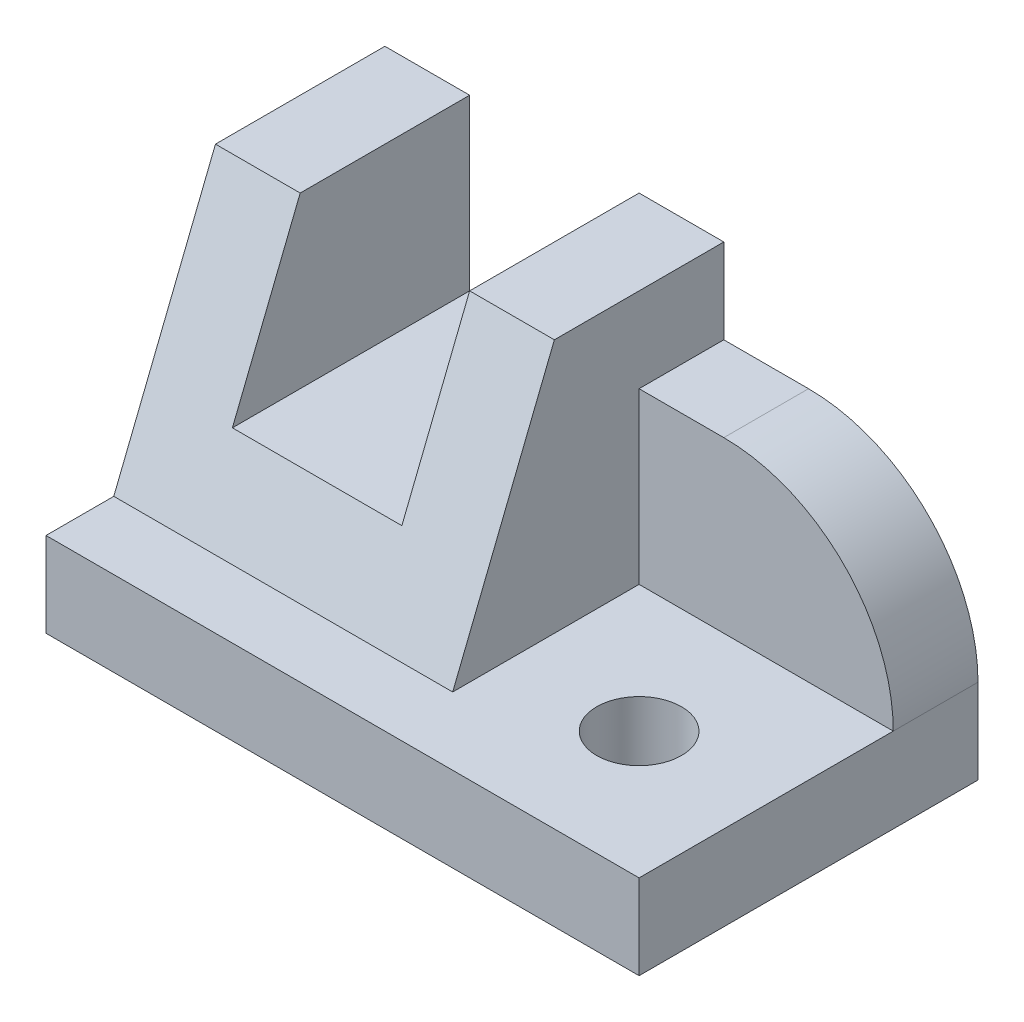
ISO-10303-21;
HEADER;
FILE_DESCRIPTION(('STEP AP214'),'2;1');
FILE_NAME('part.step','',(''),(''),'','','');
FILE_SCHEMA(('AUTOMOTIVE_DESIGN { 1 0 10303 214 1 1 1 1 }'));
ENDSEC;
DATA;
#1=APPLICATION_CONTEXT('core data for automotive mechanical design processes');
#2=APPLICATION_PROTOCOL_DEFINITION('international standard','automotive_design',2000,#1);
#3=PRODUCT_CONTEXT('',#1,'mechanical');
#4=PRODUCT('Part','Part','',(#3));
#5=PRODUCT_RELATED_PRODUCT_CATEGORY('part','',(#4));
#6=PRODUCT_DEFINITION_FORMATION('','',#4);
#7=PRODUCT_DEFINITION_CONTEXT('part definition',#1,'design');
#8=PRODUCT_DEFINITION('design','',#6,#7);
#9=PRODUCT_DEFINITION_SHAPE('','',#8);
#10=(LENGTH_UNIT() NAMED_UNIT(*) SI_UNIT(.MILLI.,.METRE.));
#11=(NAMED_UNIT(*) PLANE_ANGLE_UNIT() SI_UNIT($,.RADIAN.));
#12=(NAMED_UNIT(*) SI_UNIT($,.STERADIAN.) SOLID_ANGLE_UNIT());
#13=UNCERTAINTY_MEASURE_WITH_UNIT(LENGTH_MEASURE(1.E-05),#10,'distance_accuracy_value','');
#14=(GEOMETRIC_REPRESENTATION_CONTEXT(3) GLOBAL_UNCERTAINTY_ASSIGNED_CONTEXT((#13)) GLOBAL_UNIT_ASSIGNED_CONTEXT((#10,
#11,#12)) REPRESENTATION_CONTEXT('',''));
#15=CARTESIAN_POINT('',(0.,0.,0.));
#16=DIRECTION('',(0.,0.,1.));
#17=DIRECTION('',(1.,0.,0.));
#18=AXIS2_PLACEMENT_3D('',#15,#16,#17);
#19=CARTESIAN_POINT('',(40.,40.,-40.));
#20=DIRECTION('',(0.,-1.,0.));
#21=DIRECTION('',(0.,0.,-1.));
#22=AXIS2_PLACEMENT_3D('',#19,#20,#21);
#23=PLANE('',#22);
#24=DIRECTION('',(-1.,0.,0.));
#25=VECTOR('',#24,1.);
#26=CARTESIAN_POINT('',(40.,40.,-20.));
#27=LINE('',#26,#25);
#28=CARTESIAN_POINT('',(9.99999999999998,40.,-20.));
#29=VERTEX_POINT('',#28);
#30=CARTESIAN_POINT('',(0.,40.,-20.));
#31=VERTEX_POINT('',#30);
#32=EDGE_CURVE('E235',#29,#31,#27,.T.);
#33=ORIENTED_EDGE('',*,*,#32,.F.);
#34=DIRECTION('',(0.,0.,-1.));
#35=VECTOR('',#34,1.);
#36=CARTESIAN_POINT('',(9.99999999999998,40.,0.));
#37=LINE('',#36,#35);
#38=CARTESIAN_POINT('',(9.99999999999999,40.,-40.));
#39=VERTEX_POINT('',#38);
#40=EDGE_CURVE('E160',#29,#39,#37,.T.);
#41=ORIENTED_EDGE('',*,*,#40,.T.);
#42=DIRECTION('',(1.,0.,0.));
#43=VECTOR('',#42,1.);
#44=CARTESIAN_POINT('',(40.,40.,-40.));
#45=LINE('',#44,#43);
#46=CARTESIAN_POINT('',(0.,40.,-40.));
#47=VERTEX_POINT('',#46);
#48=EDGE_CURVE('E219',#47,#39,#45,.T.);
#49=ORIENTED_EDGE('',*,*,#48,.F.);
#50=DIRECTION('',(0.,0.,1.));
#51=VECTOR('',#50,1.);
#52=CARTESIAN_POINT('',(0.,40.,-40.));
#53=LINE('',#52,#51);
#54=EDGE_CURVE('E221',#47,#31,#53,.T.);
#55=ORIENTED_EDGE('',*,*,#54,.T.);
#56=EDGE_LOOP('',(#33,#41,#49,#55));
#57=FACE_BOUND('',#56,.T.);
#58=ADVANCED_FACE('F35',(#57),#23,.F.);
#59=CARTESIAN_POINT('',(40.,10.,-8.00000000000001));
#60=DIRECTION('',(0.,0.371390676354104,0.928476690885259));
#61=DIRECTION('',(0.,-0.928476690885259,0.371390676354104));
#62=AXIS2_PLACEMENT_3D('',#59,#60,#61);
#63=PLANE('',#62);
#64=DIRECTION('',(0.,-0.928476690885259,0.371390676354104));
#65=VECTOR('',#64,1.);
#66=CARTESIAN_POINT('',(9.99999999999998,10.,-8.00000000000001));
#67=LINE('',#66,#65);
#68=CARTESIAN_POINT('',(9.99999999999998,20.,-12.));
#69=VERTEX_POINT('',#68);
#70=EDGE_CURVE('E168',#29,#69,#67,.T.);
#71=ORIENTED_EDGE('',*,*,#70,.F.);
#72=ORIENTED_EDGE('',*,*,#32,.T.);
#73=DIRECTION('',(0.,0.928476690885259,-0.371390676354104));
#74=VECTOR('',#73,1.);
#75=CARTESIAN_POINT('',(0.,10.,-8.00000000000001));
#76=LINE('',#75,#74);
#77=CARTESIAN_POINT('',(0.,10.,-8.00000000000001));
#78=VERTEX_POINT('',#77);
#79=EDGE_CURVE('E224',#78,#31,#76,.T.);
#80=ORIENTED_EDGE('',*,*,#79,.F.);
#81=DIRECTION('',(-1.,0.,0.));
#82=VECTOR('',#81,1.);
#83=CARTESIAN_POINT('',(40.,10.,-8.00000000000001));
#84=LINE('',#83,#82);
#85=CARTESIAN_POINT('',(40.,10.,-8.00000000000001));
#86=VERTEX_POINT('',#85);
#87=EDGE_CURVE('E228',#86,#78,#84,.T.);
#88=ORIENTED_EDGE('',*,*,#87,.F.);
#89=DIRECTION('',(0.,0.928476690885259,-0.371390676354104));
#90=VECTOR('',#89,1.);
#91=CARTESIAN_POINT('',(40.,10.,-8.00000000000001));
#92=LINE('',#91,#90);
#93=CARTESIAN_POINT('',(40.,40.,-20.));
#94=VERTEX_POINT('',#93);
#95=EDGE_CURVE('E225',#86,#94,#92,.T.);
#96=ORIENTED_EDGE('',*,*,#95,.T.);
#97=CARTESIAN_POINT('',(30.,40.,-20.));
#98=VERTEX_POINT('',#97);
#99=EDGE_CURVE('E231',#94,#98,#27,.T.);
#100=ORIENTED_EDGE('',*,*,#99,.T.);
#101=DIRECTION('',(0.,0.928476690885259,-0.371390676354104));
#102=VECTOR('',#101,1.);
#103=CARTESIAN_POINT('',(30.,10.,-8.00000000000001));
#104=LINE('',#103,#102);
#105=CARTESIAN_POINT('',(30.,20.,-12.));
#106=VERTEX_POINT('',#105);
#107=EDGE_CURVE('E163',#106,#98,#104,.T.);
#108=ORIENTED_EDGE('',*,*,#107,.F.);
#109=DIRECTION('',(1.,0.,0.));
#110=VECTOR('',#109,1.);
#111=CARTESIAN_POINT('',(40.,20.,-12.));
#112=LINE('',#111,#110);
#113=EDGE_CURVE('E140',#69,#106,#112,.T.);
#114=ORIENTED_EDGE('',*,*,#113,.F.);
#115=EDGE_LOOP('',(#71,#72,#80,#88,#96,#100,#108,#114));
#116=FACE_BOUND('',#115,.T.);
#117=ADVANCED_FACE('F267',(#116),#63,.T.);
#118=CARTESIAN_POINT('',(0.,0.,0.));
#119=DIRECTION('',(1.,0.,0.));
#120=DIRECTION('',(0.,0.,-1.));
#121=AXIS2_PLACEMENT_3D('',#118,#119,#120);
#122=PLANE('',#121);
#123=DIRECTION('',(0.,1.,0.));
#124=VECTOR('',#123,1.);
#125=CARTESIAN_POINT('',(0.,40.,-40.));
#126=LINE('',#125,#124);
#127=CARTESIAN_POINT('',(0.,0.,-40.));
#128=VERTEX_POINT('',#127);
#129=EDGE_CURVE('E216',#128,#47,#126,.T.);
#130=ORIENTED_EDGE('',*,*,#129,.F.);
#131=DIRECTION('',(0.,0.,-1.));
#132=VECTOR('',#131,1.);
#133=CARTESIAN_POINT('',(0.,0.,-40.));
#134=LINE('',#133,#132);
#135=CARTESIAN_POINT('',(0.,0.,0.));
#136=VERTEX_POINT('',#135);
#137=EDGE_CURVE('E174',#136,#128,#134,.T.);
#138=ORIENTED_EDGE('',*,*,#137,.F.);
#139=DIRECTION('',(0.,1.,0.));
#140=VECTOR('',#139,1.);
#141=CARTESIAN_POINT('',(0.,0.,0.));
#142=LINE('',#141,#140);
#143=CARTESIAN_POINT('',(0.,10.,0.));
#144=VERTEX_POINT('',#143);
#145=EDGE_CURVE('E192',#136,#144,#142,.T.);
#146=ORIENTED_EDGE('',*,*,#145,.T.);
#147=DIRECTION('',(0.,0.,-1.));
#148=VECTOR('',#147,1.);
#149=CARTESIAN_POINT('',(0.,10.,-40.));
#150=LINE('',#149,#148);
#151=EDGE_CURVE('E186',#144,#78,#150,.T.);
#152=ORIENTED_EDGE('',*,*,#151,.T.);
#153=ORIENTED_EDGE('',*,*,#79,.T.);
#154=ORIENTED_EDGE('',*,*,#54,.F.);
#155=EDGE_LOOP('',(#130,#138,#146,#152,#153,#154));
#156=FACE_BOUND('',#155,.T.);
#157=ADVANCED_FACE('F270',(#156),#122,.F.);
#158=CARTESIAN_POINT('',(30.,40.,-40.));
#159=VERTEX_POINT('',#158);
#160=CARTESIAN_POINT('',(40.,40.,-40.));
#161=VERTEX_POINT('',#160);
#162=EDGE_CURVE('E218',#159,#161,#45,.T.);
#163=ORIENTED_EDGE('',*,*,#162,.F.);
#164=DIRECTION('',(0.,0.,-1.));
#165=VECTOR('',#164,1.);
#166=CARTESIAN_POINT('',(30.,40.,0.));
#167=LINE('',#166,#165);
#168=EDGE_CURVE('E144',#98,#159,#167,.T.);
#169=ORIENTED_EDGE('',*,*,#168,.F.);
#170=ORIENTED_EDGE('',*,*,#99,.F.);
#171=DIRECTION('',(0.,0.,1.));
#172=VECTOR('',#171,1.);
#173=CARTESIAN_POINT('',(40.,40.,-40.));
#174=LINE('',#173,#172);
#175=EDGE_CURVE('E195',#161,#94,#174,.T.);
#176=ORIENTED_EDGE('',*,*,#175,.F.);
#177=EDGE_LOOP('',(#163,#169,#170,#176));
#178=FACE_BOUND('',#177,.T.);
#179=ADVANCED_FACE('F264',(#178),#23,.F.);
#180=CARTESIAN_POINT('',(0.,0.,-40.));
#181=DIRECTION('',(0.,0.,1.));
#182=DIRECTION('',(0.,-1.,0.));
#183=AXIS2_PLACEMENT_3D('',#180,#181,#182);
#184=PLANE('',#183);
#185=DIRECTION('',(1.,0.,0.));
#186=VECTOR('',#185,1.);
#187=CARTESIAN_POINT('',(40.,30.,-40.));
#188=LINE('',#187,#186);
#189=CARTESIAN_POINT('',(40.,30.,-40.));
#190=VERTEX_POINT('',#189);
#191=CARTESIAN_POINT('',(50.,30.,-40.));
#192=VERTEX_POINT('',#191);
#193=EDGE_CURVE('E209',#190,#192,#188,.T.);
#194=ORIENTED_EDGE('',*,*,#193,.T.);
#195=CARTESIAN_POINT('',(50.,9.99999999999999,-40.));
#196=DIRECTION('',(0.,0.,1.));
#197=DIRECTION('',(0.,-1.,0.));
#198=AXIS2_PLACEMENT_3D('',#195,#196,#197);
#199=CIRCLE('',#198,20.);
#200=CARTESIAN_POINT('',(70.,10.,-40.));
#201=VERTEX_POINT('',#200);
#202=EDGE_CURVE('E50',#192,#201,#199,.F.);
#203=ORIENTED_EDGE('',*,*,#202,.T.);
#204=DIRECTION('',(0.,1.,0.));
#205=VECTOR('',#204,1.);
#206=CARTESIAN_POINT('',(70.,40.,-40.));
#207=LINE('',#206,#205);
#208=CARTESIAN_POINT('',(70.,0.,-40.));
#209=VERTEX_POINT('',#208);
#210=EDGE_CURVE('E211',#209,#201,#207,.T.);
#211=ORIENTED_EDGE('',*,*,#210,.F.);
#212=DIRECTION('',(1.,0.,0.));
#213=VECTOR('',#212,1.);
#214=CARTESIAN_POINT('',(70.,0.,-40.));
#215=LINE('',#214,#213);
#216=EDGE_CURVE('E178',#128,#209,#215,.T.);
#217=ORIENTED_EDGE('',*,*,#216,.F.);
#218=ORIENTED_EDGE('',*,*,#129,.T.);
#219=ORIENTED_EDGE('',*,*,#48,.T.);
#220=DIRECTION('',(0.,1.,0.));
#221=VECTOR('',#220,1.);
#222=CARTESIAN_POINT('',(9.99999999999999,20.,-40.));
#223=LINE('',#222,#221);
#224=CARTESIAN_POINT('',(9.99999999999999,20.,-40.));
#225=VERTEX_POINT('',#224);
#226=EDGE_CURVE('E155',#225,#39,#223,.T.);
#227=ORIENTED_EDGE('',*,*,#226,.F.);
#228=DIRECTION('',(-1.,0.,0.));
#229=VECTOR('',#228,1.);
#230=CARTESIAN_POINT('',(30.,20.,-40.));
#231=LINE('',#230,#229);
#232=CARTESIAN_POINT('',(30.,20.,-40.));
#233=VERTEX_POINT('',#232);
#234=EDGE_CURVE('E137',#233,#225,#231,.T.);
#235=ORIENTED_EDGE('',*,*,#234,.F.);
#236=DIRECTION('',(0.,-1.,0.));
#237=VECTOR('',#236,1.);
#238=CARTESIAN_POINT('',(30.,40.,-40.));
#239=LINE('',#238,#237);
#240=EDGE_CURVE('E147',#159,#233,#239,.T.);
#241=ORIENTED_EDGE('',*,*,#240,.F.);
#242=ORIENTED_EDGE('',*,*,#162,.T.);
#243=DIRECTION('',(0.,1.,0.));
#244=VECTOR('',#243,1.);
#245=CARTESIAN_POINT('',(40.,30.,-40.));
#246=LINE('',#245,#244);
#247=EDGE_CURVE('E205',#190,#161,#246,.T.);
#248=ORIENTED_EDGE('',*,*,#247,.F.);
#249=EDGE_LOOP('',(#194,#203,#211,#217,#218,#219,#227,#235,#241,#242,#248));
#250=FACE_BOUND('',#249,.T.);
#251=ADVANCED_FACE('F153',(#250),#184,.F.);
#252=CARTESIAN_POINT('',(70.,0.,0.));
#253=DIRECTION('',(-1.,0.,0.));
#254=DIRECTION('',(0.,0.,1.));
#255=AXIS2_PLACEMENT_3D('',#252,#253,#254);
#256=PLANE('',#255);
#257=ORIENTED_EDGE('',*,*,#210,.T.);
#258=DIRECTION('',(0.,0.,-1.));
#259=VECTOR('',#258,1.);
#260=CARTESIAN_POINT('',(70.,9.99999999999999,0.));
#261=LINE('',#260,#259);
#262=CARTESIAN_POINT('',(70.,10.,-30.));
#263=VERTEX_POINT('',#262);
#264=EDGE_CURVE('E43',#201,#263,#261,.F.);
#265=ORIENTED_EDGE('',*,*,#264,.T.);
#266=DIRECTION('',(0.,0.,1.));
#267=VECTOR('',#266,1.);
#268=CARTESIAN_POINT('',(70.,10.,0.));
#269=LINE('',#268,#267);
#270=CARTESIAN_POINT('',(70.,10.,0.));
#271=VERTEX_POINT('',#270);
#272=EDGE_CURVE('E175',#263,#271,#269,.T.);
#273=ORIENTED_EDGE('',*,*,#272,.T.);
#274=DIRECTION('',(0.,1.,0.));
#275=VECTOR('',#274,1.);
#276=CARTESIAN_POINT('',(70.,0.,0.));
#277=LINE('',#276,#275);
#278=CARTESIAN_POINT('',(70.,0.,0.));
#279=VERTEX_POINT('',#278);
#280=EDGE_CURVE('E183',#279,#271,#277,.T.);
#281=ORIENTED_EDGE('',*,*,#280,.F.);
#282=DIRECTION('',(0.,0.,1.));
#283=VECTOR('',#282,1.);
#284=CARTESIAN_POINT('',(70.,0.,0.));
#285=LINE('',#284,#283);
#286=EDGE_CURVE('E181',#209,#279,#285,.T.);
#287=ORIENTED_EDGE('',*,*,#286,.F.);
#288=EDGE_LOOP('',(#257,#265,#273,#281,#287));
#289=FACE_BOUND('',#288,.T.);
#290=ADVANCED_FACE('F242',(#289),#256,.F.);
#291=CARTESIAN_POINT('',(40.,30.,-30.));
#292=DIRECTION('',(0.,-1.,0.));
#293=DIRECTION('',(0.,0.,-1.));
#294=AXIS2_PLACEMENT_3D('',#291,#292,#293);
#295=PLANE('',#294);
#296=DIRECTION('',(1.,0.,0.));
#297=VECTOR('',#296,1.);
#298=CARTESIAN_POINT('',(40.,30.,-30.));
#299=LINE('',#298,#297);
#300=CARTESIAN_POINT('',(40.,30.,-30.));
#301=VERTEX_POINT('',#300);
#302=CARTESIAN_POINT('',(50.,30.,-30.));
#303=VERTEX_POINT('',#302);
#304=EDGE_CURVE('E212',#301,#303,#299,.T.);
#305=ORIENTED_EDGE('',*,*,#304,.T.);
#306=DIRECTION('',(0.,0.,-1.));
#307=VECTOR('',#306,1.);
#308=CARTESIAN_POINT('',(50.,30.,-30.));
#309=LINE('',#308,#307);
#310=EDGE_CURVE('E234',#303,#192,#309,.T.);
#311=ORIENTED_EDGE('',*,*,#310,.T.);
#312=ORIENTED_EDGE('',*,*,#193,.F.);
#313=DIRECTION('',(0.,0.,-1.));
#314=VECTOR('',#313,1.);
#315=CARTESIAN_POINT('',(40.,30.,-30.));
#316=LINE('',#315,#314);
#317=EDGE_CURVE('E202',#301,#190,#316,.T.);
#318=ORIENTED_EDGE('',*,*,#317,.F.);
#319=EDGE_LOOP('',(#305,#311,#312,#318));
#320=FACE_BOUND('',#319,.T.);
#321=ADVANCED_FACE('F256',(#320),#295,.F.);
#322=CARTESIAN_POINT('',(40.,10.,-30.));
#323=DIRECTION('',(0.,0.,-1.));
#324=DIRECTION('',(-1.,0.,0.));
#325=AXIS2_PLACEMENT_3D('',#322,#323,#324);
#326=PLANE('',#325);
#327=DIRECTION('',(1.,0.,0.));
#328=VECTOR('',#327,1.);
#329=CARTESIAN_POINT('',(40.,10.,-30.));
#330=LINE('',#329,#328);
#331=CARTESIAN_POINT('',(40.,10.,-30.));
#332=VERTEX_POINT('',#331);
#333=EDGE_CURVE('E208',#332,#263,#330,.T.);
#334=ORIENTED_EDGE('',*,*,#333,.T.);
#335=CARTESIAN_POINT('',(50.,9.99999999999999,-30.));
#336=DIRECTION('',(0.,0.,-1.));
#337=DIRECTION('',(-1.,0.,0.));
#338=AXIS2_PLACEMENT_3D('',#335,#336,#337);
#339=CIRCLE('',#338,20.);
#340=EDGE_CURVE('E11',#263,#303,#339,.F.);
#341=ORIENTED_EDGE('',*,*,#340,.T.);
#342=ORIENTED_EDGE('',*,*,#304,.F.);
#343=DIRECTION('',(0.,1.,0.));
#344=VECTOR('',#343,1.);
#345=CARTESIAN_POINT('',(40.,10.,-30.));
#346=LINE('',#345,#344);
#347=EDGE_CURVE('E199',#332,#301,#346,.T.);
#348=ORIENTED_EDGE('',*,*,#347,.F.);
#349=EDGE_LOOP('',(#334,#341,#342,#348));
#350=FACE_BOUND('',#349,.T.);
#351=ADVANCED_FACE('F249',(#350),#326,.F.);
#352=CARTESIAN_POINT('',(40.,0.,0.));
#353=DIRECTION('',(-1.,0.,0.));
#354=DIRECTION('',(0.,0.,1.));
#355=AXIS2_PLACEMENT_3D('',#352,#353,#354);
#356=PLANE('',#355);
#357=ORIENTED_EDGE('',*,*,#95,.F.);
#358=DIRECTION('',(0.,0.,-1.));
#359=VECTOR('',#358,1.);
#360=CARTESIAN_POINT('',(40.,10.,0.));
#361=LINE('',#360,#359);
#362=EDGE_CURVE('E197',#86,#332,#361,.T.);
#363=ORIENTED_EDGE('',*,*,#362,.T.);
#364=ORIENTED_EDGE('',*,*,#347,.T.);
#365=ORIENTED_EDGE('',*,*,#317,.T.);
#366=ORIENTED_EDGE('',*,*,#247,.T.);
#367=ORIENTED_EDGE('',*,*,#175,.T.);
#368=EDGE_LOOP('',(#357,#363,#364,#365,#366,#367));
#369=FACE_BOUND('',#368,.T.);
#370=ADVANCED_FACE('F261',(#369),#356,.F.);
#371=CARTESIAN_POINT('',(0.,10.,0.));
#372=DIRECTION('',(0.,1.,0.));
#373=DIRECTION('',(0.,0.,1.));
#374=AXIS2_PLACEMENT_3D('',#371,#372,#373);
#375=PLANE('',#374);
#376=CARTESIAN_POINT('',(55.,10.,-15.));
#377=DIRECTION('',(0.,1.,0.));
#378=DIRECTION('',(0.,0.,1.));
#379=AXIS2_PLACEMENT_3D('',#376,#377,#378);
#380=CIRCLE('',#379,4.99999999999998);
#381=CARTESIAN_POINT('',(55.,10.,-10.));
#382=VERTEX_POINT('',#381);
#383=EDGE_CURVE('E151',#382,#382,#380,.T.);
#384=ORIENTED_EDGE('',*,*,#383,.F.);
#385=EDGE_LOOP('',(#384));
#386=FACE_BOUND('',#385,.T.);
#387=ORIENTED_EDGE('',*,*,#333,.F.);
#388=ORIENTED_EDGE('',*,*,#362,.F.);
#389=ORIENTED_EDGE('',*,*,#87,.T.);
#390=ORIENTED_EDGE('',*,*,#151,.F.);
#391=DIRECTION('',(-1.,0.,0.));
#392=VECTOR('',#391,1.);
#393=CARTESIAN_POINT('',(0.,10.,0.));
#394=LINE('',#393,#392);
#395=EDGE_CURVE('E170',#271,#144,#394,.T.);
#396=ORIENTED_EDGE('',*,*,#395,.F.);
#397=ORIENTED_EDGE('',*,*,#272,.F.);
#398=EDGE_LOOP('',(#387,#388,#389,#390,#396,#397));
#399=FACE_BOUND('',#398,.T.);
#400=ADVANCED_FACE('F253',(#386,#399),#375,.T.);
#401=CARTESIAN_POINT('',(0.,0.,0.));
#402=DIRECTION('',(0.,0.,-1.));
#403=DIRECTION('',(-1.,0.,0.));
#404=AXIS2_PLACEMENT_3D('',#401,#402,#403);
#405=PLANE('',#404);
#406=ORIENTED_EDGE('',*,*,#395,.T.);
#407=ORIENTED_EDGE('',*,*,#145,.F.);
#408=DIRECTION('',(-1.,0.,0.));
#409=VECTOR('',#408,1.);
#410=CARTESIAN_POINT('',(0.,0.,0.));
#411=LINE('',#410,#409);
#412=EDGE_CURVE('E171',#279,#136,#411,.T.);
#413=ORIENTED_EDGE('',*,*,#412,.F.);
#414=ORIENTED_EDGE('',*,*,#280,.T.);
#415=EDGE_LOOP('',(#406,#407,#413,#414));
#416=FACE_BOUND('',#415,.T.);
#417=ADVANCED_FACE('F275',(#416),#405,.F.);
#418=CARTESIAN_POINT('',(0.,0.,0.));
#419=DIRECTION('',(0.,1.,0.));
#420=DIRECTION('',(0.,0.,1.));
#421=AXIS2_PLACEMENT_3D('',#418,#419,#420);
#422=PLANE('',#421);
#423=CARTESIAN_POINT('',(55.,0.,-15.));
#424=DIRECTION('',(0.,-1.,0.));
#425=DIRECTION('',(0.,0.,-1.));
#426=AXIS2_PLACEMENT_3D('',#423,#424,#425);
#427=CIRCLE('',#426,4.99999999999998);
#428=CARTESIAN_POINT('',(55.,0.,-20.));
#429=VERTEX_POINT('',#428);
#430=EDGE_CURVE('E440',#429,#429,#427,.T.);
#431=ORIENTED_EDGE('',*,*,#430,.F.);
#432=EDGE_LOOP('',(#431));
#433=FACE_BOUND('',#432,.T.);
#434=ORIENTED_EDGE('',*,*,#412,.T.);
#435=ORIENTED_EDGE('',*,*,#137,.T.);
#436=ORIENTED_EDGE('',*,*,#216,.T.);
#437=ORIENTED_EDGE('',*,*,#286,.T.);
#438=EDGE_LOOP('',(#434,#435,#436,#437));
#439=FACE_BOUND('',#438,.T.);
#440=ADVANCED_FACE('F277',(#433,#439),#422,.F.);
#441=CARTESIAN_POINT('',(9.99999999999998,20.,0.));
#442=DIRECTION('',(-1.,0.,0.));
#443=DIRECTION('',(0.,0.,1.));
#444=AXIS2_PLACEMENT_3D('',#441,#442,#443);
#445=PLANE('',#444);
#446=ORIENTED_EDGE('',*,*,#70,.T.);
#447=DIRECTION('',(0.,0.,-1.));
#448=VECTOR('',#447,1.);
#449=CARTESIAN_POINT('',(9.99999999999998,20.,0.));
#450=LINE('',#449,#448);
#451=EDGE_CURVE('E143',#69,#225,#450,.T.);
#452=ORIENTED_EDGE('',*,*,#451,.T.);
#453=ORIENTED_EDGE('',*,*,#226,.T.);
#454=ORIENTED_EDGE('',*,*,#40,.F.);
#455=EDGE_LOOP('',(#446,#452,#453,#454));
#456=FACE_BOUND('',#455,.T.);
#457=ADVANCED_FACE('F283',(#456),#445,.F.);
#458=CARTESIAN_POINT('',(30.,20.,0.));
#459=DIRECTION('',(0.,-1.,0.));
#460=DIRECTION('',(0.,0.,-1.));
#461=AXIS2_PLACEMENT_3D('',#458,#459,#460);
#462=PLANE('',#461);
#463=ORIENTED_EDGE('',*,*,#113,.T.);
#464=DIRECTION('',(0.,0.,-1.));
#465=VECTOR('',#464,1.);
#466=CARTESIAN_POINT('',(30.,20.,0.));
#467=LINE('',#466,#465);
#468=EDGE_CURVE('E132',#106,#233,#467,.T.);
#469=ORIENTED_EDGE('',*,*,#468,.T.);
#470=ORIENTED_EDGE('',*,*,#234,.T.);
#471=ORIENTED_EDGE('',*,*,#451,.F.);
#472=EDGE_LOOP('',(#463,#469,#470,#471));
#473=FACE_BOUND('',#472,.T.);
#474=ADVANCED_FACE('F134',(#473),#462,.F.);
#475=CARTESIAN_POINT('',(30.,40.,0.));
#476=DIRECTION('',(1.,0.,0.));
#477=DIRECTION('',(0.,0.,-1.));
#478=AXIS2_PLACEMENT_3D('',#475,#476,#477);
#479=PLANE('',#478);
#480=ORIENTED_EDGE('',*,*,#107,.T.);
#481=ORIENTED_EDGE('',*,*,#168,.T.);
#482=ORIENTED_EDGE('',*,*,#240,.T.);
#483=ORIENTED_EDGE('',*,*,#468,.F.);
#484=EDGE_LOOP('',(#480,#481,#482,#483));
#485=FACE_BOUND('',#484,.T.);
#486=ADVANCED_FACE('F148',(#485),#479,.F.);
#487=CARTESIAN_POINT('',(55.,0.,-15.));
#488=DIRECTION('',(0.,-1.,0.));
#489=DIRECTION('',(0.,0.,-1.));
#490=AXIS2_PLACEMENT_3D('',#487,#488,#489);
#491=CYLINDRICAL_SURFACE('',#490,4.99999999999998);
#492=ORIENTED_EDGE('',*,*,#383,.T.);
#493=EDGE_LOOP('',(#492));
#494=FACE_BOUND('',#493,.T.);
#495=ORIENTED_EDGE('',*,*,#430,.T.);
#496=EDGE_LOOP('',(#495));
#497=FACE_BOUND('',#496,.T.);
#498=ADVANCED_FACE('F343',(#494,#497),#491,.F.);
#499=CARTESIAN_POINT('',(50.,9.99999999999999,-30.));
#500=DIRECTION('',(0.,0.,-1.));
#501=DIRECTION('',(-1.,0.,0.));
#502=AXIS2_PLACEMENT_3D('',#499,#500,#501);
#503=CYLINDRICAL_SURFACE('',#502,20.);
#504=ORIENTED_EDGE('',*,*,#340,.F.);
#505=ORIENTED_EDGE('',*,*,#264,.F.);
#506=ORIENTED_EDGE('',*,*,#202,.F.);
#507=ORIENTED_EDGE('',*,*,#310,.F.);
#508=EDGE_LOOP('',(#504,#505,#506,#507));
#509=FACE_BOUND('',#508,.T.);
#510=ADVANCED_FACE('F37',(#509),#503,.T.);
#511=CLOSED_SHELL('',(#58,#117,#157,#179,#251,#290,#321,#351,#370,#400,#417,#440,#457,#474,#486,
#498,#510));
#512=MANIFOLD_SOLID_BREP('B2',#511);
#513=ADVANCED_BREP_SHAPE_REPRESENTATION('',(#18,#512),#14);
#514=SHAPE_DEFINITION_REPRESENTATION(#9,#513);
ENDSEC;
END-ISO-10303-21;
